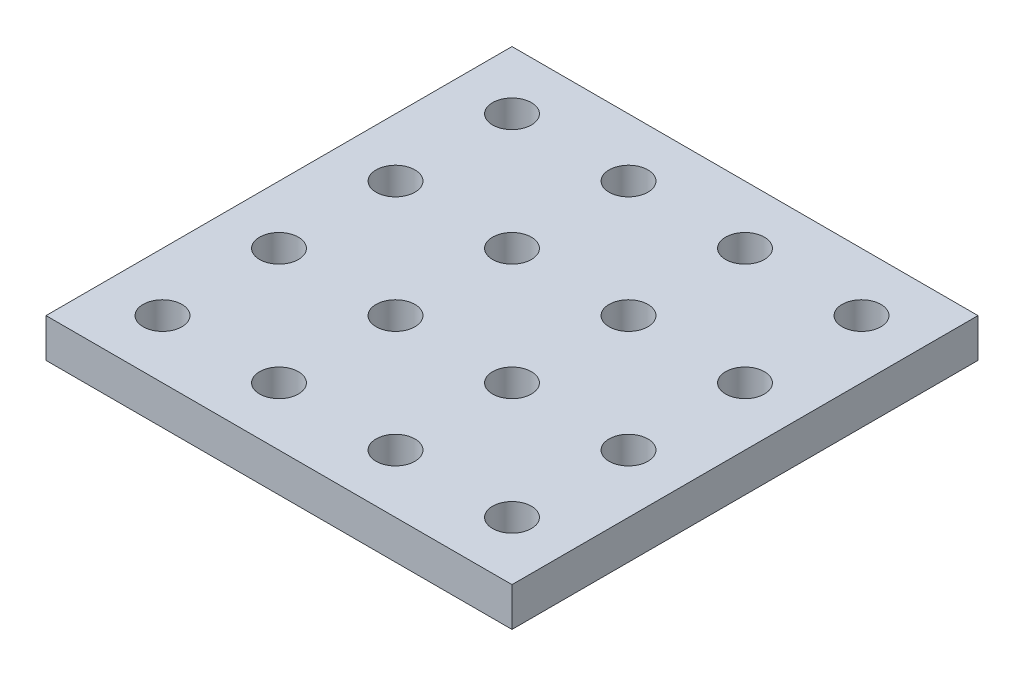
ISO-10303-21;
HEADER;
FILE_DESCRIPTION(('STEP AP214'),'2;1');
FILE_NAME('part.step','',(''),(''),'','','');
FILE_SCHEMA(('AUTOMOTIVE_DESIGN { 1 0 10303 214 1 1 1 1 }'));
ENDSEC;
DATA;
#1=APPLICATION_CONTEXT('core data for automotive mechanical design processes');
#2=APPLICATION_PROTOCOL_DEFINITION('international standard','automotive_design',2000,#1);
#3=PRODUCT_CONTEXT('',#1,'mechanical');
#4=PRODUCT('Part','Part','',(#3));
#5=PRODUCT_RELATED_PRODUCT_CATEGORY('part','',(#4));
#6=PRODUCT_DEFINITION_FORMATION('','',#4);
#7=PRODUCT_DEFINITION_CONTEXT('part definition',#1,'design');
#8=PRODUCT_DEFINITION('design','',#6,#7);
#9=PRODUCT_DEFINITION_SHAPE('','',#8);
#10=(LENGTH_UNIT() NAMED_UNIT(*) SI_UNIT(.MILLI.,.METRE.));
#11=(NAMED_UNIT(*) PLANE_ANGLE_UNIT() SI_UNIT($,.RADIAN.));
#12=(NAMED_UNIT(*) SI_UNIT($,.STERADIAN.) SOLID_ANGLE_UNIT());
#13=UNCERTAINTY_MEASURE_WITH_UNIT(LENGTH_MEASURE(1.E-05),#10,'distance_accuracy_value','');
#14=(GEOMETRIC_REPRESENTATION_CONTEXT(3) GLOBAL_UNCERTAINTY_ASSIGNED_CONTEXT((#13)) GLOBAL_UNIT_ASSIGNED_CONTEXT((#10,
#11,#12)) REPRESENTATION_CONTEXT('',''));
#15=CARTESIAN_POINT('',(0.,0.,0.));
#16=DIRECTION('',(0.,0.,1.));
#17=DIRECTION('',(1.,0.,0.));
#18=AXIS2_PLACEMENT_3D('',#15,#16,#17);
#19=CARTESIAN_POINT('',(0.,10.,0.));
#20=DIRECTION('',(1.,0.,0.));
#21=DIRECTION('',(0.,0.,-1.));
#22=AXIS2_PLACEMENT_3D('',#19,#20,#21);
#23=PLANE('',#22);
#24=DIRECTION('',(0.,0.,1.));
#25=VECTOR('',#24,1.);
#26=CARTESIAN_POINT('',(0.,0.,0.));
#27=LINE('',#26,#25);
#28=CARTESIAN_POINT('',(0.,0.,-120.));
#29=VERTEX_POINT('',#28);
#30=CARTESIAN_POINT('',(0.,0.,0.));
#31=VERTEX_POINT('',#30);
#32=EDGE_CURVE('E108',#29,#31,#27,.T.);
#33=ORIENTED_EDGE('',*,*,#32,.T.);
#34=DIRECTION('',(0.,-1.,0.));
#35=VECTOR('',#34,1.);
#36=CARTESIAN_POINT('',(0.,10.,0.));
#37=LINE('',#36,#35);
#38=CARTESIAN_POINT('',(0.,10.,0.));
#39=VERTEX_POINT('',#38);
#40=EDGE_CURVE('E99',#39,#31,#37,.T.);
#41=ORIENTED_EDGE('',*,*,#40,.F.);
#42=DIRECTION('',(0.,0.,1.));
#43=VECTOR('',#42,1.);
#44=CARTESIAN_POINT('',(0.,10.,0.));
#45=LINE('',#44,#43);
#46=CARTESIAN_POINT('',(0.,10.,-120.));
#47=VERTEX_POINT('',#46);
#48=EDGE_CURVE('E93',#47,#39,#45,.T.);
#49=ORIENTED_EDGE('',*,*,#48,.F.);
#50=DIRECTION('',(0.,-1.,0.));
#51=VECTOR('',#50,1.);
#52=CARTESIAN_POINT('',(0.,10.,-120.));
#53=LINE('',#52,#51);
#54=EDGE_CURVE('E104',#47,#29,#53,.T.);
#55=ORIENTED_EDGE('',*,*,#54,.T.);
#56=EDGE_LOOP('',(#33,#41,#49,#55));
#57=FACE_BOUND('',#56,.T.);
#58=ADVANCED_FACE('F39',(#57),#23,.F.);
#59=CARTESIAN_POINT('',(0.,10.,0.));
#60=DIRECTION('',(0.,0.,-1.));
#61=DIRECTION('',(-1.,0.,0.));
#62=AXIS2_PLACEMENT_3D('',#59,#60,#61);
#63=PLANE('',#62);
#64=DIRECTION('',(1.,0.,0.));
#65=VECTOR('',#64,1.);
#66=CARTESIAN_POINT('',(0.,0.,0.));
#67=LINE('',#66,#65);
#68=CARTESIAN_POINT('',(120.,0.,0.));
#69=VERTEX_POINT('',#68);
#70=EDGE_CURVE('E98',#31,#69,#67,.T.);
#71=ORIENTED_EDGE('',*,*,#70,.T.);
#72=DIRECTION('',(0.,-1.,0.));
#73=VECTOR('',#72,1.);
#74=CARTESIAN_POINT('',(120.,10.,0.));
#75=LINE('',#74,#73);
#76=CARTESIAN_POINT('',(120.,10.,0.));
#77=VERTEX_POINT('',#76);
#78=EDGE_CURVE('E96',#77,#69,#75,.T.);
#79=ORIENTED_EDGE('',*,*,#78,.F.);
#80=DIRECTION('',(1.,0.,0.));
#81=VECTOR('',#80,1.);
#82=CARTESIAN_POINT('',(0.,10.,0.));
#83=LINE('',#82,#81);
#84=EDGE_CURVE('E87',#39,#77,#83,.T.);
#85=ORIENTED_EDGE('',*,*,#84,.F.);
#86=ORIENTED_EDGE('',*,*,#40,.T.);
#87=EDGE_LOOP('',(#71,#79,#85,#86));
#88=FACE_BOUND('',#87,.T.);
#89=ADVANCED_FACE('F97',(#88),#63,.F.);
#90=CARTESIAN_POINT('',(120.,10.,0.));
#91=DIRECTION('',(-1.,0.,0.));
#92=DIRECTION('',(0.,0.,1.));
#93=AXIS2_PLACEMENT_3D('',#90,#91,#92);
#94=PLANE('',#93);
#95=DIRECTION('',(0.,0.,-1.));
#96=VECTOR('',#95,1.);
#97=CARTESIAN_POINT('',(120.,0.,0.));
#98=LINE('',#97,#96);
#99=CARTESIAN_POINT('',(120.,0.,-120.));
#100=VERTEX_POINT('',#99);
#101=EDGE_CURVE('E73',#69,#100,#98,.T.);
#102=ORIENTED_EDGE('',*,*,#101,.T.);
#103=DIRECTION('',(0.,-1.,0.));
#104=VECTOR('',#103,1.);
#105=CARTESIAN_POINT('',(120.,10.,-120.));
#106=LINE('',#105,#104);
#107=CARTESIAN_POINT('',(120.,10.,-120.));
#108=VERTEX_POINT('',#107);
#109=EDGE_CURVE('E100',#108,#100,#106,.T.);
#110=ORIENTED_EDGE('',*,*,#109,.F.);
#111=DIRECTION('',(0.,0.,-1.));
#112=VECTOR('',#111,1.);
#113=CARTESIAN_POINT('',(120.,10.,0.));
#114=LINE('',#113,#112);
#115=EDGE_CURVE('E91',#77,#108,#114,.T.);
#116=ORIENTED_EDGE('',*,*,#115,.F.);
#117=ORIENTED_EDGE('',*,*,#78,.T.);
#118=EDGE_LOOP('',(#102,#110,#116,#117));
#119=FACE_BOUND('',#118,.T.);
#120=ADVANCED_FACE('F102',(#119),#94,.F.);
#121=CARTESIAN_POINT('',(0.,10.,-120.));
#122=DIRECTION('',(0.,0.,1.));
#123=DIRECTION('',(1.,0.,0.));
#124=AXIS2_PLACEMENT_3D('',#121,#122,#123);
#125=PLANE('',#124);
#126=DIRECTION('',(-1.,0.,0.));
#127=VECTOR('',#126,1.);
#128=CARTESIAN_POINT('',(0.,0.,-120.));
#129=LINE('',#128,#127);
#130=EDGE_CURVE('E79',#100,#29,#129,.T.);
#131=ORIENTED_EDGE('',*,*,#130,.T.);
#132=ORIENTED_EDGE('',*,*,#54,.F.);
#133=DIRECTION('',(-1.,0.,0.));
#134=VECTOR('',#133,1.);
#135=CARTESIAN_POINT('',(0.,10.,-120.));
#136=LINE('',#135,#134);
#137=EDGE_CURVE('E56',#108,#47,#136,.T.);
#138=ORIENTED_EDGE('',*,*,#137,.F.);
#139=ORIENTED_EDGE('',*,*,#109,.T.);
#140=EDGE_LOOP('',(#131,#132,#138,#139));
#141=FACE_BOUND('',#140,.T.);
#142=ADVANCED_FACE('F206',(#141),#125,.F.);
#143=CARTESIAN_POINT('',(0.,10.,0.));
#144=DIRECTION('',(0.,-1.,0.));
#145=DIRECTION('',(0.,0.,-1.));
#146=AXIS2_PLACEMENT_3D('',#143,#144,#145);
#147=PLANE('',#146);
#148=CARTESIAN_POINT('',(45.,10.,-15.));
#149=DIRECTION('',(0.,1.,0.));
#150=DIRECTION('',(0.,0.,1.));
#151=AXIS2_PLACEMENT_3D('',#148,#149,#150);
#152=CIRCLE('',#151,5.);
#153=CARTESIAN_POINT('',(45.,10.,-10.));
#154=VERTEX_POINT('',#153);
#155=EDGE_CURVE('E424',#154,#154,#152,.T.);
#156=ORIENTED_EDGE('',*,*,#155,.F.);
#157=EDGE_LOOP('',(#156));
#158=FACE_BOUND('',#157,.T.);
#159=CARTESIAN_POINT('',(15.,10.,-15.));
#160=DIRECTION('',(0.,1.,0.));
#161=DIRECTION('',(0.,0.,1.));
#162=AXIS2_PLACEMENT_3D('',#159,#160,#161);
#163=CIRCLE('',#162,5.);
#164=CARTESIAN_POINT('',(15.,10.,-10.));
#165=VERTEX_POINT('',#164);
#166=EDGE_CURVE('E423',#165,#165,#163,.T.);
#167=ORIENTED_EDGE('',*,*,#166,.F.);
#168=EDGE_LOOP('',(#167));
#169=FACE_BOUND('',#168,.T.);
#170=ORIENTED_EDGE('',*,*,#48,.T.);
#171=ORIENTED_EDGE('',*,*,#84,.T.);
#172=ORIENTED_EDGE('',*,*,#115,.T.);
#173=ORIENTED_EDGE('',*,*,#137,.T.);
#174=EDGE_LOOP('',(#170,#171,#172,#173));
#175=FACE_BOUND('',#174,.T.);
#176=CARTESIAN_POINT('',(75.,10.,-15.));
#177=DIRECTION('',(0.,1.,0.));
#178=DIRECTION('',(0.,0.,1.));
#179=AXIS2_PLACEMENT_3D('',#176,#177,#178);
#180=CIRCLE('',#179,5.);
#181=CARTESIAN_POINT('',(75.,10.,-10.));
#182=VERTEX_POINT('',#181);
#183=EDGE_CURVE('E121',#182,#182,#180,.T.);
#184=ORIENTED_EDGE('',*,*,#183,.F.);
#185=EDGE_LOOP('',(#184));
#186=FACE_BOUND('',#185,.T.);
#187=CARTESIAN_POINT('',(105.,10.,-15.));
#188=DIRECTION('',(0.,1.,0.));
#189=DIRECTION('',(0.,0.,1.));
#190=AXIS2_PLACEMENT_3D('',#187,#188,#189);
#191=CIRCLE('',#190,5.);
#192=CARTESIAN_POINT('',(105.,10.,-10.));
#193=VERTEX_POINT('',#192);
#194=EDGE_CURVE('E127',#193,#193,#191,.T.);
#195=ORIENTED_EDGE('',*,*,#194,.F.);
#196=EDGE_LOOP('',(#195));
#197=FACE_BOUND('',#196,.T.);
#198=CARTESIAN_POINT('',(15.,10.,-45.));
#199=DIRECTION('',(0.,1.,0.));
#200=DIRECTION('',(0.,0.,1.));
#201=AXIS2_PLACEMENT_3D('',#198,#199,#200);
#202=CIRCLE('',#201,5.);
#203=CARTESIAN_POINT('',(15.,10.,-40.));
#204=VERTEX_POINT('',#203);
#205=EDGE_CURVE('E133',#204,#204,#202,.T.);
#206=ORIENTED_EDGE('',*,*,#205,.F.);
#207=EDGE_LOOP('',(#206));
#208=FACE_BOUND('',#207,.T.);
#209=CARTESIAN_POINT('',(45.,10.,-45.));
#210=DIRECTION('',(0.,1.,0.));
#211=DIRECTION('',(0.,0.,1.));
#212=AXIS2_PLACEMENT_3D('',#209,#210,#211);
#213=CIRCLE('',#212,5.);
#214=CARTESIAN_POINT('',(45.,10.,-40.));
#215=VERTEX_POINT('',#214);
#216=EDGE_CURVE('E139',#215,#215,#213,.T.);
#217=ORIENTED_EDGE('',*,*,#216,.F.);
#218=EDGE_LOOP('',(#217));
#219=FACE_BOUND('',#218,.T.);
#220=CARTESIAN_POINT('',(75.,10.,-45.));
#221=DIRECTION('',(0.,1.,0.));
#222=DIRECTION('',(0.,0.,1.));
#223=AXIS2_PLACEMENT_3D('',#220,#221,#222);
#224=CIRCLE('',#223,5.);
#225=CARTESIAN_POINT('',(75.,10.,-40.));
#226=VERTEX_POINT('',#225);
#227=EDGE_CURVE('E145',#226,#226,#224,.T.);
#228=ORIENTED_EDGE('',*,*,#227,.F.);
#229=EDGE_LOOP('',(#228));
#230=FACE_BOUND('',#229,.T.);
#231=CARTESIAN_POINT('',(105.,10.,-45.));
#232=DIRECTION('',(0.,1.,0.));
#233=DIRECTION('',(0.,0.,1.));
#234=AXIS2_PLACEMENT_3D('',#231,#232,#233);
#235=CIRCLE('',#234,5.);
#236=CARTESIAN_POINT('',(105.,10.,-40.));
#237=VERTEX_POINT('',#236);
#238=EDGE_CURVE('E151',#237,#237,#235,.T.);
#239=ORIENTED_EDGE('',*,*,#238,.F.);
#240=EDGE_LOOP('',(#239));
#241=FACE_BOUND('',#240,.T.);
#242=CARTESIAN_POINT('',(15.,10.,-75.));
#243=DIRECTION('',(0.,1.,0.));
#244=DIRECTION('',(0.,0.,1.));
#245=AXIS2_PLACEMENT_3D('',#242,#243,#244);
#246=CIRCLE('',#245,5.);
#247=CARTESIAN_POINT('',(15.,10.,-70.));
#248=VERTEX_POINT('',#247);
#249=EDGE_CURVE('E157',#248,#248,#246,.T.);
#250=ORIENTED_EDGE('',*,*,#249,.F.);
#251=EDGE_LOOP('',(#250));
#252=FACE_BOUND('',#251,.T.);
#253=CARTESIAN_POINT('',(45.,10.,-75.));
#254=DIRECTION('',(0.,1.,0.));
#255=DIRECTION('',(0.,0.,1.));
#256=AXIS2_PLACEMENT_3D('',#253,#254,#255);
#257=CIRCLE('',#256,5.);
#258=CARTESIAN_POINT('',(45.,10.,-70.));
#259=VERTEX_POINT('',#258);
#260=EDGE_CURVE('E163',#259,#259,#257,.T.);
#261=ORIENTED_EDGE('',*,*,#260,.F.);
#262=EDGE_LOOP('',(#261));
#263=FACE_BOUND('',#262,.T.);
#264=CARTESIAN_POINT('',(75.,10.,-75.));
#265=DIRECTION('',(0.,1.,0.));
#266=DIRECTION('',(0.,0.,1.));
#267=AXIS2_PLACEMENT_3D('',#264,#265,#266);
#268=CIRCLE('',#267,5.);
#269=CARTESIAN_POINT('',(75.,10.,-70.));
#270=VERTEX_POINT('',#269);
#271=EDGE_CURVE('E169',#270,#270,#268,.T.);
#272=ORIENTED_EDGE('',*,*,#271,.F.);
#273=EDGE_LOOP('',(#272));
#274=FACE_BOUND('',#273,.T.);
#275=CARTESIAN_POINT('',(105.,10.,-75.));
#276=DIRECTION('',(0.,1.,0.));
#277=DIRECTION('',(0.,0.,1.));
#278=AXIS2_PLACEMENT_3D('',#275,#276,#277);
#279=CIRCLE('',#278,5.);
#280=CARTESIAN_POINT('',(105.,10.,-70.));
#281=VERTEX_POINT('',#280);
#282=EDGE_CURVE('E175',#281,#281,#279,.T.);
#283=ORIENTED_EDGE('',*,*,#282,.F.);
#284=EDGE_LOOP('',(#283));
#285=FACE_BOUND('',#284,.T.);
#286=CARTESIAN_POINT('',(15.,10.,-105.));
#287=DIRECTION('',(0.,1.,0.));
#288=DIRECTION('',(0.,0.,1.));
#289=AXIS2_PLACEMENT_3D('',#286,#287,#288);
#290=CIRCLE('',#289,5.);
#291=CARTESIAN_POINT('',(15.,10.,-100.));
#292=VERTEX_POINT('',#291);
#293=EDGE_CURVE('E181',#292,#292,#290,.T.);
#294=ORIENTED_EDGE('',*,*,#293,.F.);
#295=EDGE_LOOP('',(#294));
#296=FACE_BOUND('',#295,.T.);
#297=CARTESIAN_POINT('',(45.,10.,-105.));
#298=DIRECTION('',(0.,1.,0.));
#299=DIRECTION('',(0.,0.,1.));
#300=AXIS2_PLACEMENT_3D('',#297,#298,#299);
#301=CIRCLE('',#300,5.);
#302=CARTESIAN_POINT('',(45.,10.,-100.));
#303=VERTEX_POINT('',#302);
#304=EDGE_CURVE('E187',#303,#303,#301,.T.);
#305=ORIENTED_EDGE('',*,*,#304,.F.);
#306=EDGE_LOOP('',(#305));
#307=FACE_BOUND('',#306,.T.);
#308=CARTESIAN_POINT('',(75.,10.,-105.));
#309=DIRECTION('',(0.,1.,0.));
#310=DIRECTION('',(0.,0.,1.));
#311=AXIS2_PLACEMENT_3D('',#308,#309,#310);
#312=CIRCLE('',#311,5.);
#313=CARTESIAN_POINT('',(75.,10.,-100.));
#314=VERTEX_POINT('',#313);
#315=EDGE_CURVE('E193',#314,#314,#312,.T.);
#316=ORIENTED_EDGE('',*,*,#315,.F.);
#317=EDGE_LOOP('',(#316));
#318=FACE_BOUND('',#317,.T.);
#319=CARTESIAN_POINT('',(105.,10.,-105.));
#320=DIRECTION('',(0.,1.,0.));
#321=DIRECTION('',(0.,0.,1.));
#322=AXIS2_PLACEMENT_3D('',#319,#320,#321);
#323=CIRCLE('',#322,5.);
#324=CARTESIAN_POINT('',(105.,10.,-100.));
#325=VERTEX_POINT('',#324);
#326=EDGE_CURVE('E11',#325,#325,#323,.T.);
#327=ORIENTED_EDGE('',*,*,#326,.F.);
#328=EDGE_LOOP('',(#327));
#329=FACE_BOUND('',#328,.T.);
#330=ADVANCED_FACE('F88',(#158,#169,#175,#186,#197,#208,#219,#230,#241,#252,#263,#274,#285,#296,
#307,#318,#329),#147,.F.);
#331=CARTESIAN_POINT('',(0.,0.,0.));
#332=DIRECTION('',(0.,-1.,0.));
#333=DIRECTION('',(0.,0.,-1.));
#334=AXIS2_PLACEMENT_3D('',#331,#332,#333);
#335=PLANE('',#334);
#336=CARTESIAN_POINT('',(45.,0.,-15.));
#337=DIRECTION('',(0.,1.,0.));
#338=DIRECTION('',(0.,0.,1.));
#339=AXIS2_PLACEMENT_3D('',#336,#337,#338);
#340=CIRCLE('',#339,5.);
#341=CARTESIAN_POINT('',(45.,0.,-10.));
#342=VERTEX_POINT('',#341);
#343=EDGE_CURVE('E428',#342,#342,#340,.T.);
#344=ORIENTED_EDGE('',*,*,#343,.T.);
#345=EDGE_LOOP('',(#344));
#346=FACE_BOUND('',#345,.T.);
#347=CARTESIAN_POINT('',(15.,0.,-15.));
#348=DIRECTION('',(0.,1.,0.));
#349=DIRECTION('',(0.,0.,1.));
#350=AXIS2_PLACEMENT_3D('',#347,#348,#349);
#351=CIRCLE('',#350,5.);
#352=CARTESIAN_POINT('',(15.,0.,-10.));
#353=VERTEX_POINT('',#352);
#354=EDGE_CURVE('E111',#353,#353,#351,.T.);
#355=ORIENTED_EDGE('',*,*,#354,.T.);
#356=EDGE_LOOP('',(#355));
#357=FACE_BOUND('',#356,.T.);
#358=ORIENTED_EDGE('',*,*,#32,.F.);
#359=ORIENTED_EDGE('',*,*,#130,.F.);
#360=ORIENTED_EDGE('',*,*,#101,.F.);
#361=ORIENTED_EDGE('',*,*,#70,.F.);
#362=EDGE_LOOP('',(#358,#359,#360,#361));
#363=FACE_BOUND('',#362,.T.);
#364=CARTESIAN_POINT('',(75.,0.,-15.));
#365=DIRECTION('',(0.,1.,0.));
#366=DIRECTION('',(0.,0.,1.));
#367=AXIS2_PLACEMENT_3D('',#364,#365,#366);
#368=CIRCLE('',#367,5.);
#369=CARTESIAN_POINT('',(75.,0.,-10.));
#370=VERTEX_POINT('',#369);
#371=EDGE_CURVE('E118',#370,#370,#368,.T.);
#372=ORIENTED_EDGE('',*,*,#371,.T.);
#373=EDGE_LOOP('',(#372));
#374=FACE_BOUND('',#373,.T.);
#375=CARTESIAN_POINT('',(105.,0.,-15.));
#376=DIRECTION('',(0.,1.,0.));
#377=DIRECTION('',(0.,0.,1.));
#378=AXIS2_PLACEMENT_3D('',#375,#376,#377);
#379=CIRCLE('',#378,5.);
#380=CARTESIAN_POINT('',(105.,0.,-10.));
#381=VERTEX_POINT('',#380);
#382=EDGE_CURVE('E124',#381,#381,#379,.T.);
#383=ORIENTED_EDGE('',*,*,#382,.T.);
#384=EDGE_LOOP('',(#383));
#385=FACE_BOUND('',#384,.T.);
#386=CARTESIAN_POINT('',(15.,0.,-45.));
#387=DIRECTION('',(0.,1.,0.));
#388=DIRECTION('',(0.,0.,1.));
#389=AXIS2_PLACEMENT_3D('',#386,#387,#388);
#390=CIRCLE('',#389,5.);
#391=CARTESIAN_POINT('',(15.,0.,-40.));
#392=VERTEX_POINT('',#391);
#393=EDGE_CURVE('E130',#392,#392,#390,.T.);
#394=ORIENTED_EDGE('',*,*,#393,.T.);
#395=EDGE_LOOP('',(#394));
#396=FACE_BOUND('',#395,.T.);
#397=CARTESIAN_POINT('',(45.,0.,-45.));
#398=DIRECTION('',(0.,1.,0.));
#399=DIRECTION('',(0.,0.,1.));
#400=AXIS2_PLACEMENT_3D('',#397,#398,#399);
#401=CIRCLE('',#400,5.);
#402=CARTESIAN_POINT('',(45.,0.,-40.));
#403=VERTEX_POINT('',#402);
#404=EDGE_CURVE('E136',#403,#403,#401,.T.);
#405=ORIENTED_EDGE('',*,*,#404,.T.);
#406=EDGE_LOOP('',(#405));
#407=FACE_BOUND('',#406,.T.);
#408=CARTESIAN_POINT('',(75.,0.,-45.));
#409=DIRECTION('',(0.,1.,0.));
#410=DIRECTION('',(0.,0.,1.));
#411=AXIS2_PLACEMENT_3D('',#408,#409,#410);
#412=CIRCLE('',#411,5.);
#413=CARTESIAN_POINT('',(75.,0.,-40.));
#414=VERTEX_POINT('',#413);
#415=EDGE_CURVE('E142',#414,#414,#412,.T.);
#416=ORIENTED_EDGE('',*,*,#415,.T.);
#417=EDGE_LOOP('',(#416));
#418=FACE_BOUND('',#417,.T.);
#419=CARTESIAN_POINT('',(105.,0.,-45.));
#420=DIRECTION('',(0.,1.,0.));
#421=DIRECTION('',(0.,0.,1.));
#422=AXIS2_PLACEMENT_3D('',#419,#420,#421);
#423=CIRCLE('',#422,5.);
#424=CARTESIAN_POINT('',(105.,0.,-40.));
#425=VERTEX_POINT('',#424);
#426=EDGE_CURVE('E148',#425,#425,#423,.T.);
#427=ORIENTED_EDGE('',*,*,#426,.T.);
#428=EDGE_LOOP('',(#427));
#429=FACE_BOUND('',#428,.T.);
#430=CARTESIAN_POINT('',(15.,0.,-75.));
#431=DIRECTION('',(0.,1.,0.));
#432=DIRECTION('',(0.,0.,1.));
#433=AXIS2_PLACEMENT_3D('',#430,#431,#432);
#434=CIRCLE('',#433,5.);
#435=CARTESIAN_POINT('',(15.,0.,-70.));
#436=VERTEX_POINT('',#435);
#437=EDGE_CURVE('E154',#436,#436,#434,.T.);
#438=ORIENTED_EDGE('',*,*,#437,.T.);
#439=EDGE_LOOP('',(#438));
#440=FACE_BOUND('',#439,.T.);
#441=CARTESIAN_POINT('',(45.,0.,-75.));
#442=DIRECTION('',(0.,1.,0.));
#443=DIRECTION('',(0.,0.,1.));
#444=AXIS2_PLACEMENT_3D('',#441,#442,#443);
#445=CIRCLE('',#444,5.);
#446=CARTESIAN_POINT('',(45.,0.,-70.));
#447=VERTEX_POINT('',#446);
#448=EDGE_CURVE('E160',#447,#447,#445,.T.);
#449=ORIENTED_EDGE('',*,*,#448,.T.);
#450=EDGE_LOOP('',(#449));
#451=FACE_BOUND('',#450,.T.);
#452=CARTESIAN_POINT('',(75.,0.,-75.));
#453=DIRECTION('',(0.,1.,0.));
#454=DIRECTION('',(0.,0.,1.));
#455=AXIS2_PLACEMENT_3D('',#452,#453,#454);
#456=CIRCLE('',#455,5.);
#457=CARTESIAN_POINT('',(75.,0.,-70.));
#458=VERTEX_POINT('',#457);
#459=EDGE_CURVE('E166',#458,#458,#456,.T.);
#460=ORIENTED_EDGE('',*,*,#459,.T.);
#461=EDGE_LOOP('',(#460));
#462=FACE_BOUND('',#461,.T.);
#463=CARTESIAN_POINT('',(105.,0.,-75.));
#464=DIRECTION('',(0.,1.,0.));
#465=DIRECTION('',(0.,0.,1.));
#466=AXIS2_PLACEMENT_3D('',#463,#464,#465);
#467=CIRCLE('',#466,5.);
#468=CARTESIAN_POINT('',(105.,0.,-70.));
#469=VERTEX_POINT('',#468);
#470=EDGE_CURVE('E172',#469,#469,#467,.T.);
#471=ORIENTED_EDGE('',*,*,#470,.T.);
#472=EDGE_LOOP('',(#471));
#473=FACE_BOUND('',#472,.T.);
#474=CARTESIAN_POINT('',(15.,0.,-105.));
#475=DIRECTION('',(0.,1.,0.));
#476=DIRECTION('',(0.,0.,1.));
#477=AXIS2_PLACEMENT_3D('',#474,#475,#476);
#478=CIRCLE('',#477,5.);
#479=CARTESIAN_POINT('',(15.,0.,-100.));
#480=VERTEX_POINT('',#479);
#481=EDGE_CURVE('E178',#480,#480,#478,.T.);
#482=ORIENTED_EDGE('',*,*,#481,.T.);
#483=EDGE_LOOP('',(#482));
#484=FACE_BOUND('',#483,.T.);
#485=CARTESIAN_POINT('',(45.,0.,-105.));
#486=DIRECTION('',(0.,1.,0.));
#487=DIRECTION('',(0.,0.,1.));
#488=AXIS2_PLACEMENT_3D('',#485,#486,#487);
#489=CIRCLE('',#488,5.);
#490=CARTESIAN_POINT('',(45.,0.,-100.));
#491=VERTEX_POINT('',#490);
#492=EDGE_CURVE('E184',#491,#491,#489,.T.);
#493=ORIENTED_EDGE('',*,*,#492,.T.);
#494=EDGE_LOOP('',(#493));
#495=FACE_BOUND('',#494,.T.);
#496=CARTESIAN_POINT('',(75.,0.,-105.));
#497=DIRECTION('',(0.,1.,0.));
#498=DIRECTION('',(0.,0.,1.));
#499=AXIS2_PLACEMENT_3D('',#496,#497,#498);
#500=CIRCLE('',#499,5.);
#501=CARTESIAN_POINT('',(75.,0.,-100.));
#502=VERTEX_POINT('',#501);
#503=EDGE_CURVE('E190',#502,#502,#500,.T.);
#504=ORIENTED_EDGE('',*,*,#503,.T.);
#505=EDGE_LOOP('',(#504));
#506=FACE_BOUND('',#505,.T.);
#507=CARTESIAN_POINT('',(105.,0.,-105.));
#508=DIRECTION('',(0.,1.,0.));
#509=DIRECTION('',(0.,0.,1.));
#510=AXIS2_PLACEMENT_3D('',#507,#508,#509);
#511=CIRCLE('',#510,5.);
#512=CARTESIAN_POINT('',(105.,0.,-100.));
#513=VERTEX_POINT('',#512);
#514=EDGE_CURVE('E48',#513,#513,#511,.T.);
#515=ORIENTED_EDGE('',*,*,#514,.T.);
#516=EDGE_LOOP('',(#515));
#517=FACE_BOUND('',#516,.T.);
#518=ADVANCED_FACE('F198',(#346,#357,#363,#374,#385,#396,#407,#418,#429,#440,#451,#462,#473,
#484,#495,#506,#517),#335,.T.);
#519=CARTESIAN_POINT('',(15.,0.,-15.));
#520=DIRECTION('',(0.,1.,0.));
#521=DIRECTION('',(0.,0.,1.));
#522=AXIS2_PLACEMENT_3D('',#519,#520,#521);
#523=CYLINDRICAL_SURFACE('',#522,5.);
#524=ORIENTED_EDGE('',*,*,#354,.F.);
#525=EDGE_LOOP('',(#524));
#526=FACE_BOUND('',#525,.T.);
#527=ORIENTED_EDGE('',*,*,#166,.T.);
#528=EDGE_LOOP('',(#527));
#529=FACE_BOUND('',#528,.T.);
#530=ADVANCED_FACE('F213',(#526,#529),#523,.F.);
#531=CARTESIAN_POINT('',(45.,0.,-15.));
#532=DIRECTION('',(0.,1.,0.));
#533=DIRECTION('',(0.,0.,1.));
#534=AXIS2_PLACEMENT_3D('',#531,#532,#533);
#535=CYLINDRICAL_SURFACE('',#534,5.);
#536=ORIENTED_EDGE('',*,*,#343,.F.);
#537=EDGE_LOOP('',(#536));
#538=FACE_BOUND('',#537,.T.);
#539=ORIENTED_EDGE('',*,*,#155,.T.);
#540=EDGE_LOOP('',(#539));
#541=FACE_BOUND('',#540,.T.);
#542=ADVANCED_FACE('F233',(#538,#541),#535,.F.);
#543=CARTESIAN_POINT('',(75.,0.,-15.));
#544=DIRECTION('',(0.,1.,0.));
#545=DIRECTION('',(0.,0.,1.));
#546=AXIS2_PLACEMENT_3D('',#543,#544,#545);
#547=CYLINDRICAL_SURFACE('',#546,5.);
#548=ORIENTED_EDGE('',*,*,#371,.F.);
#549=EDGE_LOOP('',(#548));
#550=FACE_BOUND('',#549,.T.);
#551=ORIENTED_EDGE('',*,*,#183,.T.);
#552=EDGE_LOOP('',(#551));
#553=FACE_BOUND('',#552,.T.);
#554=ADVANCED_FACE('F229',(#550,#553),#547,.F.);
#555=CARTESIAN_POINT('',(105.,0.,-15.));
#556=DIRECTION('',(0.,1.,0.));
#557=DIRECTION('',(0.,0.,1.));
#558=AXIS2_PLACEMENT_3D('',#555,#556,#557);
#559=CYLINDRICAL_SURFACE('',#558,5.);
#560=ORIENTED_EDGE('',*,*,#382,.F.);
#561=EDGE_LOOP('',(#560));
#562=FACE_BOUND('',#561,.T.);
#563=ORIENTED_EDGE('',*,*,#194,.T.);
#564=EDGE_LOOP('',(#563));
#565=FACE_BOUND('',#564,.T.);
#566=ADVANCED_FACE('F232',(#562,#565),#559,.F.);
#567=CARTESIAN_POINT('',(15.,0.,-45.));
#568=DIRECTION('',(0.,1.,0.));
#569=DIRECTION('',(0.,0.,1.));
#570=AXIS2_PLACEMENT_3D('',#567,#568,#569);
#571=CYLINDRICAL_SURFACE('',#570,5.);
#572=ORIENTED_EDGE('',*,*,#393,.F.);
#573=EDGE_LOOP('',(#572));
#574=FACE_BOUND('',#573,.T.);
#575=ORIENTED_EDGE('',*,*,#205,.T.);
#576=EDGE_LOOP('',(#575));
#577=FACE_BOUND('',#576,.T.);
#578=ADVANCED_FACE('F237',(#574,#577),#571,.F.);
#579=CARTESIAN_POINT('',(45.,0.,-45.));
#580=DIRECTION('',(0.,1.,0.));
#581=DIRECTION('',(0.,0.,1.));
#582=AXIS2_PLACEMENT_3D('',#579,#580,#581);
#583=CYLINDRICAL_SURFACE('',#582,5.);
#584=ORIENTED_EDGE('',*,*,#404,.F.);
#585=EDGE_LOOP('',(#584));
#586=FACE_BOUND('',#585,.T.);
#587=ORIENTED_EDGE('',*,*,#216,.T.);
#588=EDGE_LOOP('',(#587));
#589=FACE_BOUND('',#588,.T.);
#590=ADVANCED_FACE('F241',(#586,#589),#583,.F.);
#591=CARTESIAN_POINT('',(75.,0.,-45.));
#592=DIRECTION('',(0.,1.,0.));
#593=DIRECTION('',(0.,0.,1.));
#594=AXIS2_PLACEMENT_3D('',#591,#592,#593);
#595=CYLINDRICAL_SURFACE('',#594,5.);
#596=ORIENTED_EDGE('',*,*,#415,.F.);
#597=EDGE_LOOP('',(#596));
#598=FACE_BOUND('',#597,.T.);
#599=ORIENTED_EDGE('',*,*,#227,.T.);
#600=EDGE_LOOP('',(#599));
#601=FACE_BOUND('',#600,.T.);
#602=ADVANCED_FACE('F245',(#598,#601),#595,.F.);
#603=CARTESIAN_POINT('',(105.,0.,-45.));
#604=DIRECTION('',(0.,1.,0.));
#605=DIRECTION('',(0.,0.,1.));
#606=AXIS2_PLACEMENT_3D('',#603,#604,#605);
#607=CYLINDRICAL_SURFACE('',#606,5.);
#608=ORIENTED_EDGE('',*,*,#426,.F.);
#609=EDGE_LOOP('',(#608));
#610=FACE_BOUND('',#609,.T.);
#611=ORIENTED_EDGE('',*,*,#238,.T.);
#612=EDGE_LOOP('',(#611));
#613=FACE_BOUND('',#612,.T.);
#614=ADVANCED_FACE('F249',(#610,#613),#607,.F.);
#615=CARTESIAN_POINT('',(15.,0.,-75.));
#616=DIRECTION('',(0.,1.,0.));
#617=DIRECTION('',(0.,0.,1.));
#618=AXIS2_PLACEMENT_3D('',#615,#616,#617);
#619=CYLINDRICAL_SURFACE('',#618,5.);
#620=ORIENTED_EDGE('',*,*,#437,.F.);
#621=EDGE_LOOP('',(#620));
#622=FACE_BOUND('',#621,.T.);
#623=ORIENTED_EDGE('',*,*,#249,.T.);
#624=EDGE_LOOP('',(#623));
#625=FACE_BOUND('',#624,.T.);
#626=ADVANCED_FACE('F253',(#622,#625),#619,.F.);
#627=CARTESIAN_POINT('',(45.,0.,-75.));
#628=DIRECTION('',(0.,1.,0.));
#629=DIRECTION('',(0.,0.,1.));
#630=AXIS2_PLACEMENT_3D('',#627,#628,#629);
#631=CYLINDRICAL_SURFACE('',#630,5.);
#632=ORIENTED_EDGE('',*,*,#448,.F.);
#633=EDGE_LOOP('',(#632));
#634=FACE_BOUND('',#633,.T.);
#635=ORIENTED_EDGE('',*,*,#260,.T.);
#636=EDGE_LOOP('',(#635));
#637=FACE_BOUND('',#636,.T.);
#638=ADVANCED_FACE('F257',(#634,#637),#631,.F.);
#639=CARTESIAN_POINT('',(75.,0.,-75.));
#640=DIRECTION('',(0.,1.,0.));
#641=DIRECTION('',(0.,0.,1.));
#642=AXIS2_PLACEMENT_3D('',#639,#640,#641);
#643=CYLINDRICAL_SURFACE('',#642,5.);
#644=ORIENTED_EDGE('',*,*,#459,.F.);
#645=EDGE_LOOP('',(#644));
#646=FACE_BOUND('',#645,.T.);
#647=ORIENTED_EDGE('',*,*,#271,.T.);
#648=EDGE_LOOP('',(#647));
#649=FACE_BOUND('',#648,.T.);
#650=ADVANCED_FACE('F261',(#646,#649),#643,.F.);
#651=CARTESIAN_POINT('',(105.,0.,-75.));
#652=DIRECTION('',(0.,1.,0.));
#653=DIRECTION('',(0.,0.,1.));
#654=AXIS2_PLACEMENT_3D('',#651,#652,#653);
#655=CYLINDRICAL_SURFACE('',#654,5.);
#656=ORIENTED_EDGE('',*,*,#470,.F.);
#657=EDGE_LOOP('',(#656));
#658=FACE_BOUND('',#657,.T.);
#659=ORIENTED_EDGE('',*,*,#282,.T.);
#660=EDGE_LOOP('',(#659));
#661=FACE_BOUND('',#660,.T.);
#662=ADVANCED_FACE('F265',(#658,#661),#655,.F.);
#663=CARTESIAN_POINT('',(15.,0.,-105.));
#664=DIRECTION('',(0.,1.,0.));
#665=DIRECTION('',(0.,0.,1.));
#666=AXIS2_PLACEMENT_3D('',#663,#664,#665);
#667=CYLINDRICAL_SURFACE('',#666,5.);
#668=ORIENTED_EDGE('',*,*,#481,.F.);
#669=EDGE_LOOP('',(#668));
#670=FACE_BOUND('',#669,.T.);
#671=ORIENTED_EDGE('',*,*,#293,.T.);
#672=EDGE_LOOP('',(#671));
#673=FACE_BOUND('',#672,.T.);
#674=ADVANCED_FACE('F269',(#670,#673),#667,.F.);
#675=CARTESIAN_POINT('',(45.,0.,-105.));
#676=DIRECTION('',(0.,1.,0.));
#677=DIRECTION('',(0.,0.,1.));
#678=AXIS2_PLACEMENT_3D('',#675,#676,#677);
#679=CYLINDRICAL_SURFACE('',#678,5.);
#680=ORIENTED_EDGE('',*,*,#492,.F.);
#681=EDGE_LOOP('',(#680));
#682=FACE_BOUND('',#681,.T.);
#683=ORIENTED_EDGE('',*,*,#304,.T.);
#684=EDGE_LOOP('',(#683));
#685=FACE_BOUND('',#684,.T.);
#686=ADVANCED_FACE('F273',(#682,#685),#679,.F.);
#687=CARTESIAN_POINT('',(75.,0.,-105.));
#688=DIRECTION('',(0.,1.,0.));
#689=DIRECTION('',(0.,0.,1.));
#690=AXIS2_PLACEMENT_3D('',#687,#688,#689);
#691=CYLINDRICAL_SURFACE('',#690,5.);
#692=ORIENTED_EDGE('',*,*,#503,.F.);
#693=EDGE_LOOP('',(#692));
#694=FACE_BOUND('',#693,.T.);
#695=ORIENTED_EDGE('',*,*,#315,.T.);
#696=EDGE_LOOP('',(#695));
#697=FACE_BOUND('',#696,.T.);
#698=ADVANCED_FACE('F202',(#694,#697),#691,.F.);
#699=CARTESIAN_POINT('',(105.,0.,-105.));
#700=DIRECTION('',(0.,1.,0.));
#701=DIRECTION('',(0.,0.,1.));
#702=AXIS2_PLACEMENT_3D('',#699,#700,#701);
#703=CYLINDRICAL_SURFACE('',#702,5.);
#704=ORIENTED_EDGE('',*,*,#514,.F.);
#705=EDGE_LOOP('',(#704));
#706=FACE_BOUND('',#705,.T.);
#707=ORIENTED_EDGE('',*,*,#326,.T.);
#708=EDGE_LOOP('',(#707));
#709=FACE_BOUND('',#708,.T.);
#710=ADVANCED_FACE('F41',(#706,#709),#703,.F.);
#711=CLOSED_SHELL('',(#58,#89,#120,#142,#330,#518,#530,#542,#554,#566,#578,#590,#602,#614,#626,
#638,#650,#662,#674,#686,#698,#710));
#712=MANIFOLD_SOLID_BREP('B2',#711);
#713=ADVANCED_BREP_SHAPE_REPRESENTATION('',(#18,#712),#14);
#714=SHAPE_DEFINITION_REPRESENTATION(#9,#713);
ENDSEC;
END-ISO-10303-21;
